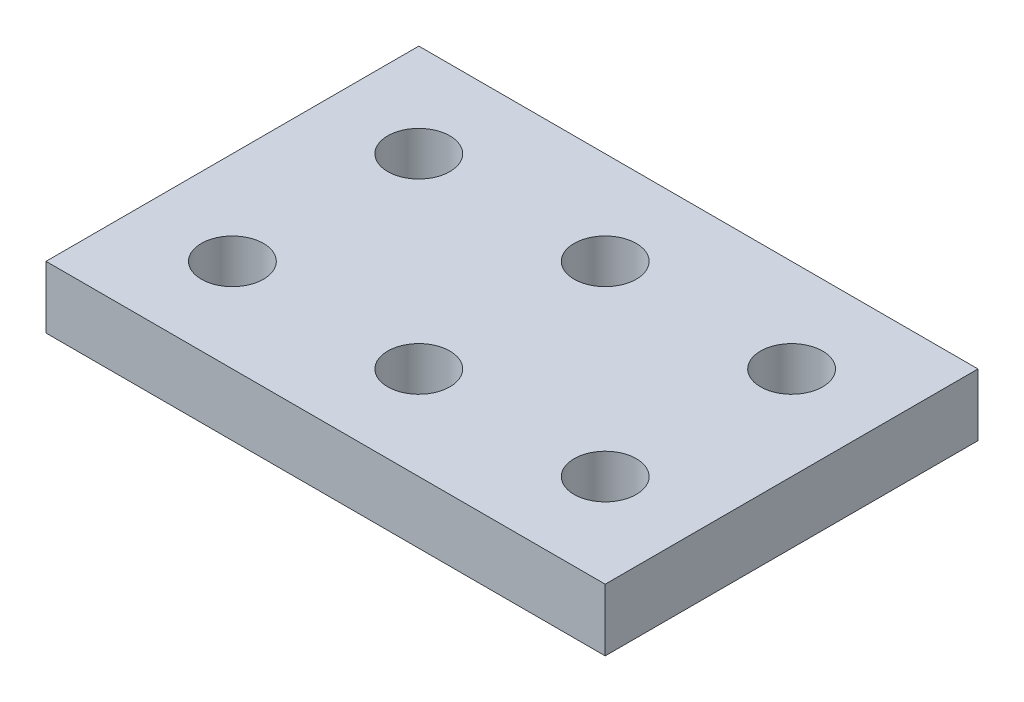
ISO-10303-21;
HEADER;
FILE_DESCRIPTION(('STEP AP214'),'2;1');
FILE_NAME('part.step','',(''),(''),'','','');
FILE_SCHEMA(('AUTOMOTIVE_DESIGN { 1 0 10303 214 1 1 1 1 }'));
ENDSEC;
DATA;
#1=APPLICATION_CONTEXT('core data for automotive mechanical design processes');
#2=APPLICATION_PROTOCOL_DEFINITION('international standard','automotive_design',2000,#1);
#3=PRODUCT_CONTEXT('',#1,'mechanical');
#4=PRODUCT('Part','Part','',(#3));
#5=PRODUCT_RELATED_PRODUCT_CATEGORY('part','',(#4));
#6=PRODUCT_DEFINITION_FORMATION('','',#4);
#7=PRODUCT_DEFINITION_CONTEXT('part definition',#1,'design');
#8=PRODUCT_DEFINITION('design','',#6,#7);
#9=PRODUCT_DEFINITION_SHAPE('','',#8);
#10=(LENGTH_UNIT() NAMED_UNIT(*) SI_UNIT(.MILLI.,.METRE.));
#11=(NAMED_UNIT(*) PLANE_ANGLE_UNIT() SI_UNIT($,.RADIAN.));
#12=(NAMED_UNIT(*) SI_UNIT($,.STERADIAN.) SOLID_ANGLE_UNIT());
#13=UNCERTAINTY_MEASURE_WITH_UNIT(LENGTH_MEASURE(1.E-05),#10,'distance_accuracy_value','');
#14=(GEOMETRIC_REPRESENTATION_CONTEXT(3) GLOBAL_UNCERTAINTY_ASSIGNED_CONTEXT((#13)) GLOBAL_UNIT_ASSIGNED_CONTEXT((#10,
#11,#12)) REPRESENTATION_CONTEXT('',''));
#15=CARTESIAN_POINT('',(0.,0.,0.));
#16=DIRECTION('',(0.,0.,1.));
#17=DIRECTION('',(1.,0.,0.));
#18=AXIS2_PLACEMENT_3D('',#15,#16,#17);
#19=CARTESIAN_POINT('',(0.,10.,0.));
#20=DIRECTION('',(1.,0.,0.));
#21=DIRECTION('',(0.,0.,-1.));
#22=AXIS2_PLACEMENT_3D('',#19,#20,#21);
#23=PLANE('',#22);
#24=DIRECTION('',(0.,0.,1.));
#25=VECTOR('',#24,1.);
#26=CARTESIAN_POINT('',(0.,0.,0.));
#27=LINE('',#26,#25);
#28=CARTESIAN_POINT('',(0.,0.,-60.));
#29=VERTEX_POINT('',#28);
#30=CARTESIAN_POINT('',(0.,0.,0.));
#31=VERTEX_POINT('',#30);
#32=EDGE_CURVE('E100',#29,#31,#27,.T.);
#33=ORIENTED_EDGE('',*,*,#32,.T.);
#34=DIRECTION('',(0.,-1.,0.));
#35=VECTOR('',#34,1.);
#36=CARTESIAN_POINT('',(0.,10.,0.));
#37=LINE('',#36,#35);
#38=CARTESIAN_POINT('',(0.,10.,0.));
#39=VERTEX_POINT('',#38);
#40=EDGE_CURVE('E11',#39,#31,#37,.T.);
#41=ORIENTED_EDGE('',*,*,#40,.F.);
#42=DIRECTION('',(0.,0.,1.));
#43=VECTOR('',#42,1.);
#44=CARTESIAN_POINT('',(0.,10.,0.));
#45=LINE('',#44,#43);
#46=CARTESIAN_POINT('',(0.,10.,-60.));
#47=VERTEX_POINT('',#46);
#48=EDGE_CURVE('E88',#47,#39,#45,.T.);
#49=ORIENTED_EDGE('',*,*,#48,.F.);
#50=DIRECTION('',(0.,-1.,0.));
#51=VECTOR('',#50,1.);
#52=CARTESIAN_POINT('',(0.,10.,-60.));
#53=LINE('',#52,#51);
#54=EDGE_CURVE('E96',#47,#29,#53,.T.);
#55=ORIENTED_EDGE('',*,*,#54,.T.);
#56=EDGE_LOOP('',(#33,#41,#49,#55));
#57=FACE_BOUND('',#56,.T.);
#58=ADVANCED_FACE('F37',(#57),#23,.F.);
#59=CARTESIAN_POINT('',(0.,10.,0.));
#60=DIRECTION('',(0.,0.,-1.));
#61=DIRECTION('',(-1.,0.,0.));
#62=AXIS2_PLACEMENT_3D('',#59,#60,#61);
#63=PLANE('',#62);
#64=DIRECTION('',(1.,0.,0.));
#65=VECTOR('',#64,1.);
#66=CARTESIAN_POINT('',(0.,0.,0.));
#67=LINE('',#66,#65);
#68=CARTESIAN_POINT('',(90.,0.,0.));
#69=VERTEX_POINT('',#68);
#70=EDGE_CURVE('E92',#31,#69,#67,.T.);
#71=ORIENTED_EDGE('',*,*,#70,.T.);
#72=DIRECTION('',(0.,-1.,0.));
#73=VECTOR('',#72,1.);
#74=CARTESIAN_POINT('',(90.,10.,0.));
#75=LINE('',#74,#73);
#76=CARTESIAN_POINT('',(90.,10.,0.));
#77=VERTEX_POINT('',#76);
#78=EDGE_CURVE('E45',#77,#69,#75,.T.);
#79=ORIENTED_EDGE('',*,*,#78,.F.);
#80=DIRECTION('',(1.,0.,0.));
#81=VECTOR('',#80,1.);
#82=CARTESIAN_POINT('',(0.,10.,0.));
#83=LINE('',#82,#81);
#84=EDGE_CURVE('E83',#39,#77,#83,.T.);
#85=ORIENTED_EDGE('',*,*,#84,.F.);
#86=ORIENTED_EDGE('',*,*,#40,.T.);
#87=EDGE_LOOP('',(#71,#79,#85,#86));
#88=FACE_BOUND('',#87,.T.);
#89=ADVANCED_FACE('F91',(#88),#63,.F.);
#90=CARTESIAN_POINT('',(90.,10.,0.));
#91=DIRECTION('',(-1.,0.,0.));
#92=DIRECTION('',(0.,0.,1.));
#93=AXIS2_PLACEMENT_3D('',#90,#91,#92);
#94=PLANE('',#93);
#95=DIRECTION('',(0.,0.,-1.));
#96=VECTOR('',#95,1.);
#97=CARTESIAN_POINT('',(90.,0.,0.));
#98=LINE('',#97,#96);
#99=CARTESIAN_POINT('',(90.,0.,-60.));
#100=VERTEX_POINT('',#99);
#101=EDGE_CURVE('E70',#69,#100,#98,.T.);
#102=ORIENTED_EDGE('',*,*,#101,.T.);
#103=DIRECTION('',(0.,-1.,0.));
#104=VECTOR('',#103,1.);
#105=CARTESIAN_POINT('',(90.,10.,-60.));
#106=LINE('',#105,#104);
#107=CARTESIAN_POINT('',(90.,10.,-60.));
#108=VERTEX_POINT('',#107);
#109=EDGE_CURVE('E93',#108,#100,#106,.T.);
#110=ORIENTED_EDGE('',*,*,#109,.F.);
#111=DIRECTION('',(0.,0.,-1.));
#112=VECTOR('',#111,1.);
#113=CARTESIAN_POINT('',(90.,10.,0.));
#114=LINE('',#113,#112);
#115=EDGE_CURVE('E86',#77,#108,#114,.T.);
#116=ORIENTED_EDGE('',*,*,#115,.F.);
#117=ORIENTED_EDGE('',*,*,#78,.T.);
#118=EDGE_LOOP('',(#102,#110,#116,#117));
#119=FACE_BOUND('',#118,.T.);
#120=ADVANCED_FACE('F94',(#119),#94,.F.);
#121=CARTESIAN_POINT('',(0.,10.,-60.));
#122=DIRECTION('',(0.,0.,1.));
#123=DIRECTION('',(1.,0.,0.));
#124=AXIS2_PLACEMENT_3D('',#121,#122,#123);
#125=PLANE('',#124);
#126=DIRECTION('',(-1.,0.,0.));
#127=VECTOR('',#126,1.);
#128=CARTESIAN_POINT('',(0.,0.,-60.));
#129=LINE('',#128,#127);
#130=EDGE_CURVE('E76',#100,#29,#129,.T.);
#131=ORIENTED_EDGE('',*,*,#130,.T.);
#132=ORIENTED_EDGE('',*,*,#54,.F.);
#133=DIRECTION('',(-1.,0.,0.));
#134=VECTOR('',#133,1.);
#135=CARTESIAN_POINT('',(0.,10.,-60.));
#136=LINE('',#135,#134);
#137=EDGE_CURVE('E53',#108,#47,#136,.T.);
#138=ORIENTED_EDGE('',*,*,#137,.F.);
#139=ORIENTED_EDGE('',*,*,#109,.T.);
#140=EDGE_LOOP('',(#131,#132,#138,#139));
#141=FACE_BOUND('',#140,.T.);
#142=ADVANCED_FACE('F108',(#141),#125,.F.);
#143=CARTESIAN_POINT('',(0.,10.,0.));
#144=DIRECTION('',(0.,-1.,0.));
#145=DIRECTION('',(0.,0.,-1.));
#146=AXIS2_PLACEMENT_3D('',#143,#144,#145);
#147=PLANE('',#146);
#148=CARTESIAN_POINT('',(75.,10.,-45.));
#149=DIRECTION('',(0.,1.,0.));
#150=DIRECTION('',(0.,0.,1.));
#151=AXIS2_PLACEMENT_3D('',#148,#149,#150);
#152=CIRCLE('',#151,5.);
#153=CARTESIAN_POINT('',(75.,10.,-40.));
#154=VERTEX_POINT('',#153);
#155=EDGE_CURVE('E144',#154,#154,#152,.T.);
#156=ORIENTED_EDGE('',*,*,#155,.F.);
#157=EDGE_LOOP('',(#156));
#158=FACE_BOUND('',#157,.T.);
#159=CARTESIAN_POINT('',(75.,10.,-15.));
#160=DIRECTION('',(0.,1.,0.));
#161=DIRECTION('',(0.,0.,1.));
#162=AXIS2_PLACEMENT_3D('',#159,#160,#161);
#163=CIRCLE('',#162,5.);
#164=CARTESIAN_POINT('',(75.,10.,-10.));
#165=VERTEX_POINT('',#164);
#166=EDGE_CURVE('E138',#165,#165,#163,.T.);
#167=ORIENTED_EDGE('',*,*,#166,.F.);
#168=EDGE_LOOP('',(#167));
#169=FACE_BOUND('',#168,.T.);
#170=CARTESIAN_POINT('',(45.,10.,-45.));
#171=DIRECTION('',(0.,1.,0.));
#172=DIRECTION('',(0.,0.,1.));
#173=AXIS2_PLACEMENT_3D('',#170,#171,#172);
#174=CIRCLE('',#173,5.);
#175=CARTESIAN_POINT('',(45.,10.,-40.));
#176=VERTEX_POINT('',#175);
#177=EDGE_CURVE('E132',#176,#176,#174,.T.);
#178=ORIENTED_EDGE('',*,*,#177,.F.);
#179=EDGE_LOOP('',(#178));
#180=FACE_BOUND('',#179,.T.);
#181=CARTESIAN_POINT('',(45.,10.,-15.));
#182=DIRECTION('',(0.,1.,0.));
#183=DIRECTION('',(0.,0.,1.));
#184=AXIS2_PLACEMENT_3D('',#181,#182,#183);
#185=CIRCLE('',#184,5.);
#186=CARTESIAN_POINT('',(45.,10.,-10.));
#187=VERTEX_POINT('',#186);
#188=EDGE_CURVE('E126',#187,#187,#185,.T.);
#189=ORIENTED_EDGE('',*,*,#188,.F.);
#190=EDGE_LOOP('',(#189));
#191=FACE_BOUND('',#190,.T.);
#192=CARTESIAN_POINT('',(15.,10.,-45.));
#193=DIRECTION('',(0.,1.,0.));
#194=DIRECTION('',(0.,0.,1.));
#195=AXIS2_PLACEMENT_3D('',#192,#193,#194);
#196=CIRCLE('',#195,5.);
#197=CARTESIAN_POINT('',(15.,10.,-40.));
#198=VERTEX_POINT('',#197);
#199=EDGE_CURVE('E120',#198,#198,#196,.T.);
#200=ORIENTED_EDGE('',*,*,#199,.F.);
#201=EDGE_LOOP('',(#200));
#202=FACE_BOUND('',#201,.T.);
#203=CARTESIAN_POINT('',(15.,10.,-15.));
#204=DIRECTION('',(0.,1.,0.));
#205=DIRECTION('',(0.,0.,1.));
#206=AXIS2_PLACEMENT_3D('',#203,#204,#205);
#207=CIRCLE('',#206,5.);
#208=CARTESIAN_POINT('',(15.,10.,-10.));
#209=VERTEX_POINT('',#208);
#210=EDGE_CURVE('E114',#209,#209,#207,.T.);
#211=ORIENTED_EDGE('',*,*,#210,.F.);
#212=EDGE_LOOP('',(#211));
#213=FACE_BOUND('',#212,.T.);
#214=ORIENTED_EDGE('',*,*,#48,.T.);
#215=ORIENTED_EDGE('',*,*,#84,.T.);
#216=ORIENTED_EDGE('',*,*,#115,.T.);
#217=ORIENTED_EDGE('',*,*,#137,.T.);
#218=EDGE_LOOP('',(#214,#215,#216,#217));
#219=FACE_BOUND('',#218,.T.);
#220=ADVANCED_FACE('F84',(#158,#169,#180,#191,#202,#213,#219),#147,.F.);
#221=CARTESIAN_POINT('',(0.,0.,0.));
#222=DIRECTION('',(0.,-1.,0.));
#223=DIRECTION('',(0.,0.,-1.));
#224=AXIS2_PLACEMENT_3D('',#221,#222,#223);
#225=PLANE('',#224);
#226=CARTESIAN_POINT('',(75.,0.,-45.));
#227=DIRECTION('',(0.,1.,0.));
#228=DIRECTION('',(0.,0.,1.));
#229=AXIS2_PLACEMENT_3D('',#226,#227,#228);
#230=CIRCLE('',#229,5.);
#231=CARTESIAN_POINT('',(75.,0.,-40.));
#232=VERTEX_POINT('',#231);
#233=EDGE_CURVE('E141',#232,#232,#230,.T.);
#234=ORIENTED_EDGE('',*,*,#233,.T.);
#235=EDGE_LOOP('',(#234));
#236=FACE_BOUND('',#235,.T.);
#237=CARTESIAN_POINT('',(75.,0.,-15.));
#238=DIRECTION('',(0.,1.,0.));
#239=DIRECTION('',(0.,0.,1.));
#240=AXIS2_PLACEMENT_3D('',#237,#238,#239);
#241=CIRCLE('',#240,5.);
#242=CARTESIAN_POINT('',(75.,0.,-10.));
#243=VERTEX_POINT('',#242);
#244=EDGE_CURVE('E135',#243,#243,#241,.T.);
#245=ORIENTED_EDGE('',*,*,#244,.T.);
#246=EDGE_LOOP('',(#245));
#247=FACE_BOUND('',#246,.T.);
#248=CARTESIAN_POINT('',(45.,0.,-45.));
#249=DIRECTION('',(0.,1.,0.));
#250=DIRECTION('',(0.,0.,1.));
#251=AXIS2_PLACEMENT_3D('',#248,#249,#250);
#252=CIRCLE('',#251,5.);
#253=CARTESIAN_POINT('',(45.,0.,-40.));
#254=VERTEX_POINT('',#253);
#255=EDGE_CURVE('E129',#254,#254,#252,.T.);
#256=ORIENTED_EDGE('',*,*,#255,.T.);
#257=EDGE_LOOP('',(#256));
#258=FACE_BOUND('',#257,.T.);
#259=CARTESIAN_POINT('',(45.,0.,-15.));
#260=DIRECTION('',(0.,1.,0.));
#261=DIRECTION('',(0.,0.,1.));
#262=AXIS2_PLACEMENT_3D('',#259,#260,#261);
#263=CIRCLE('',#262,5.);
#264=CARTESIAN_POINT('',(45.,0.,-10.));
#265=VERTEX_POINT('',#264);
#266=EDGE_CURVE('E123',#265,#265,#263,.T.);
#267=ORIENTED_EDGE('',*,*,#266,.T.);
#268=EDGE_LOOP('',(#267));
#269=FACE_BOUND('',#268,.T.);
#270=CARTESIAN_POINT('',(15.,0.,-45.));
#271=DIRECTION('',(0.,1.,0.));
#272=DIRECTION('',(0.,0.,1.));
#273=AXIS2_PLACEMENT_3D('',#270,#271,#272);
#274=CIRCLE('',#273,5.);
#275=CARTESIAN_POINT('',(15.,0.,-40.));
#276=VERTEX_POINT('',#275);
#277=EDGE_CURVE('E117',#276,#276,#274,.T.);
#278=ORIENTED_EDGE('',*,*,#277,.T.);
#279=EDGE_LOOP('',(#278));
#280=FACE_BOUND('',#279,.T.);
#281=CARTESIAN_POINT('',(15.,0.,-15.));
#282=DIRECTION('',(0.,1.,0.));
#283=DIRECTION('',(0.,0.,1.));
#284=AXIS2_PLACEMENT_3D('',#281,#282,#283);
#285=CIRCLE('',#284,5.);
#286=CARTESIAN_POINT('',(15.,0.,-10.));
#287=VERTEX_POINT('',#286);
#288=EDGE_CURVE('E103',#287,#287,#285,.T.);
#289=ORIENTED_EDGE('',*,*,#288,.T.);
#290=EDGE_LOOP('',(#289));
#291=FACE_BOUND('',#290,.T.);
#292=ORIENTED_EDGE('',*,*,#32,.F.);
#293=ORIENTED_EDGE('',*,*,#130,.F.);
#294=ORIENTED_EDGE('',*,*,#101,.F.);
#295=ORIENTED_EDGE('',*,*,#70,.F.);
#296=EDGE_LOOP('',(#292,#293,#294,#295));
#297=FACE_BOUND('',#296,.T.);
#298=ADVANCED_FACE('F111',(#236,#247,#258,#269,#280,#291,#297),#225,.T.);
#299=CARTESIAN_POINT('',(15.,0.,-15.));
#300=DIRECTION('',(0.,1.,0.));
#301=DIRECTION('',(0.,0.,1.));
#302=AXIS2_PLACEMENT_3D('',#299,#300,#301);
#303=CYLINDRICAL_SURFACE('',#302,5.);
#304=ORIENTED_EDGE('',*,*,#288,.F.);
#305=EDGE_LOOP('',(#304));
#306=FACE_BOUND('',#305,.T.);
#307=ORIENTED_EDGE('',*,*,#210,.T.);
#308=EDGE_LOOP('',(#307));
#309=FACE_BOUND('',#308,.T.);
#310=ADVANCED_FACE('F172',(#306,#309),#303,.F.);
#311=CARTESIAN_POINT('',(15.,0.,-45.));
#312=DIRECTION('',(0.,1.,0.));
#313=DIRECTION('',(0.,0.,1.));
#314=AXIS2_PLACEMENT_3D('',#311,#312,#313);
#315=CYLINDRICAL_SURFACE('',#314,5.);
#316=ORIENTED_EDGE('',*,*,#277,.F.);
#317=EDGE_LOOP('',(#316));
#318=FACE_BOUND('',#317,.T.);
#319=ORIENTED_EDGE('',*,*,#199,.T.);
#320=EDGE_LOOP('',(#319));
#321=FACE_BOUND('',#320,.T.);
#322=ADVANCED_FACE('F174',(#318,#321),#315,.F.);
#323=CARTESIAN_POINT('',(45.,0.,-15.));
#324=DIRECTION('',(0.,1.,0.));
#325=DIRECTION('',(0.,0.,1.));
#326=AXIS2_PLACEMENT_3D('',#323,#324,#325);
#327=CYLINDRICAL_SURFACE('',#326,5.);
#328=ORIENTED_EDGE('',*,*,#266,.F.);
#329=EDGE_LOOP('',(#328));
#330=FACE_BOUND('',#329,.T.);
#331=ORIENTED_EDGE('',*,*,#188,.T.);
#332=EDGE_LOOP('',(#331));
#333=FACE_BOUND('',#332,.T.);
#334=ADVANCED_FACE('F181',(#330,#333),#327,.F.);
#335=CARTESIAN_POINT('',(45.,0.,-45.));
#336=DIRECTION('',(0.,1.,0.));
#337=DIRECTION('',(0.,0.,1.));
#338=AXIS2_PLACEMENT_3D('',#335,#336,#337);
#339=CYLINDRICAL_SURFACE('',#338,5.);
#340=ORIENTED_EDGE('',*,*,#255,.F.);
#341=EDGE_LOOP('',(#340));
#342=FACE_BOUND('',#341,.T.);
#343=ORIENTED_EDGE('',*,*,#177,.T.);
#344=EDGE_LOOP('',(#343));
#345=FACE_BOUND('',#344,.T.);
#346=ADVANCED_FACE('F224',(#342,#345),#339,.F.);
#347=CARTESIAN_POINT('',(75.,0.,-15.));
#348=DIRECTION('',(0.,1.,0.));
#349=DIRECTION('',(0.,0.,1.));
#350=AXIS2_PLACEMENT_3D('',#347,#348,#349);
#351=CYLINDRICAL_SURFACE('',#350,5.);
#352=ORIENTED_EDGE('',*,*,#244,.F.);
#353=EDGE_LOOP('',(#352));
#354=FACE_BOUND('',#353,.T.);
#355=ORIENTED_EDGE('',*,*,#166,.T.);
#356=EDGE_LOOP('',(#355));
#357=FACE_BOUND('',#356,.T.);
#358=ADVANCED_FACE('F155',(#354,#357),#351,.F.);
#359=CARTESIAN_POINT('',(75.,0.,-45.));
#360=DIRECTION('',(0.,1.,0.));
#361=DIRECTION('',(0.,0.,1.));
#362=AXIS2_PLACEMENT_3D('',#359,#360,#361);
#363=CYLINDRICAL_SURFACE('',#362,5.);
#364=ORIENTED_EDGE('',*,*,#233,.F.);
#365=EDGE_LOOP('',(#364));
#366=FACE_BOUND('',#365,.T.);
#367=ORIENTED_EDGE('',*,*,#155,.T.);
#368=EDGE_LOOP('',(#367));
#369=FACE_BOUND('',#368,.T.);
#370=ADVANCED_FACE('F152',(#366,#369),#363,.F.);
#371=CLOSED_SHELL('',(#58,#89,#120,#142,#220,#298,#310,#322,#334,#346,#358,#370));
#372=MANIFOLD_SOLID_BREP('B2',#371);
#373=ADVANCED_BREP_SHAPE_REPRESENTATION('',(#18,#372),#14);
#374=SHAPE_DEFINITION_REPRESENTATION(#9,#373);
ENDSEC;
END-ISO-10303-21;
